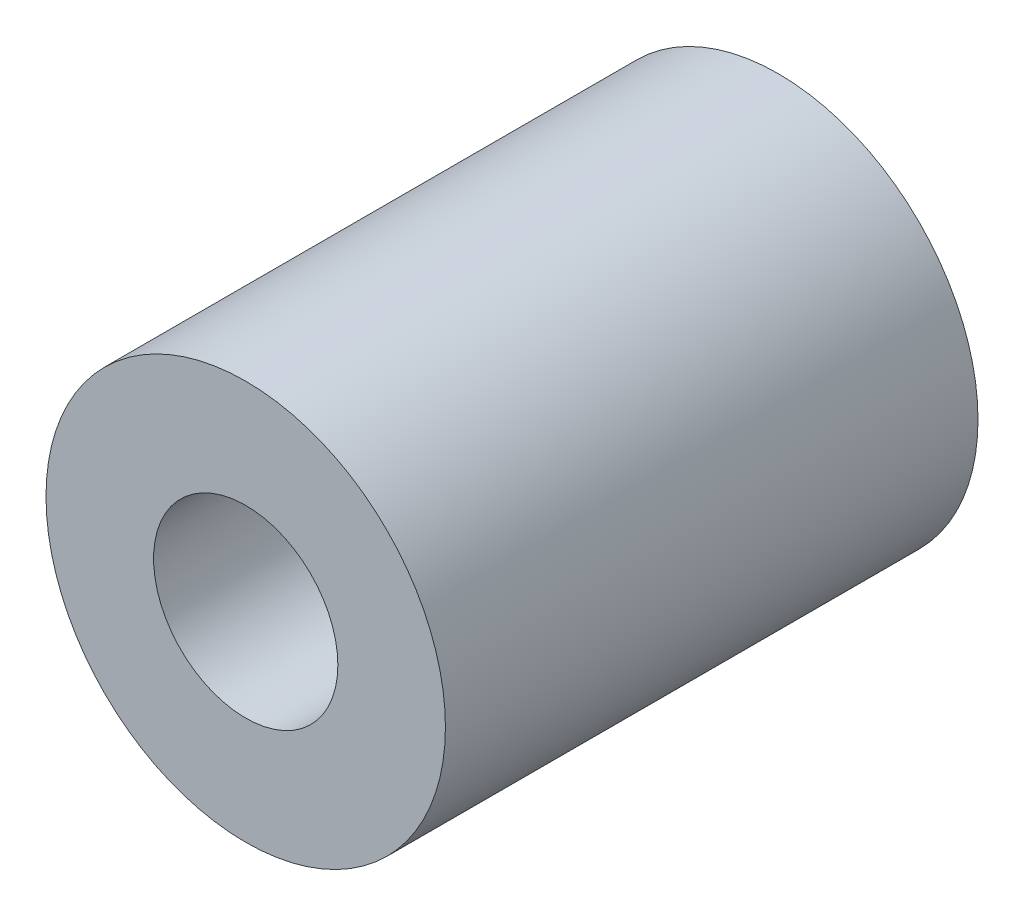
ISO-10303-21;
HEADER;
FILE_DESCRIPTION(('STEP AP214'),'2;1');
FILE_NAME('part.step','',(''),(''),'','','');
FILE_SCHEMA(('AUTOMOTIVE_DESIGN { 1 0 10303 214 1 1 1 1 }'));
ENDSEC;
DATA;
#1=APPLICATION_CONTEXT('core data for automotive mechanical design processes');
#2=APPLICATION_PROTOCOL_DEFINITION('international standard','automotive_design',2000,#1);
#3=PRODUCT_CONTEXT('',#1,'mechanical');
#4=PRODUCT('Part','Part','',(#3));
#5=PRODUCT_RELATED_PRODUCT_CATEGORY('part','',(#4));
#6=PRODUCT_DEFINITION_FORMATION('','',#4);
#7=PRODUCT_DEFINITION_CONTEXT('part definition',#1,'design');
#8=PRODUCT_DEFINITION('design','',#6,#7);
#9=PRODUCT_DEFINITION_SHAPE('','',#8);
#10=(LENGTH_UNIT() NAMED_UNIT(*) SI_UNIT(.MILLI.,.METRE.));
#11=(NAMED_UNIT(*) PLANE_ANGLE_UNIT() SI_UNIT($,.RADIAN.));
#12=(NAMED_UNIT(*) SI_UNIT($,.STERADIAN.) SOLID_ANGLE_UNIT());
#13=UNCERTAINTY_MEASURE_WITH_UNIT(LENGTH_MEASURE(1.E-05),#10,'distance_accuracy_value','');
#14=(GEOMETRIC_REPRESENTATION_CONTEXT(3) GLOBAL_UNCERTAINTY_ASSIGNED_CONTEXT((#13)) GLOBAL_UNIT_ASSIGNED_CONTEXT((#10,
#11,#12)) REPRESENTATION_CONTEXT('',''));
#15=CARTESIAN_POINT('',(0.,0.,0.));
#16=DIRECTION('',(0.,0.,1.));
#17=DIRECTION('',(1.,0.,0.));
#18=AXIS2_PLACEMENT_3D('',#15,#16,#17);
#19=CARTESIAN_POINT('',(0.,0.,6.35));
#20=DIRECTION('',(0.,0.,1.));
#21=DIRECTION('',(1.,0.,0.));
#22=AXIS2_PLACEMENT_3D('',#19,#20,#21);
#23=PLANE('',#22);
#24=CARTESIAN_POINT('',(0.,0.,6.35));
#25=DIRECTION('',(0.,0.,1.));
#26=DIRECTION('',(1.,0.,0.));
#27=AXIS2_PLACEMENT_3D('',#24,#25,#26);
#28=CIRCLE('',#27,4.7625);
#29=CARTESIAN_POINT('',(4.7625,0.,6.35));
#30=VERTEX_POINT('',#29);
#31=EDGE_CURVE('E10',#30,#30,#28,.T.);
#32=ORIENTED_EDGE('',*,*,#31,.T.);
#33=EDGE_LOOP('',(#32));
#34=FACE_BOUND('',#33,.T.);
#35=CARTESIAN_POINT('',(0.,0.,6.35));
#36=DIRECTION('',(0.,0.,1.));
#37=DIRECTION('',(1.,0.,0.));
#38=AXIS2_PLACEMENT_3D('',#35,#36,#37);
#39=CIRCLE('',#38,2.1971);
#40=CARTESIAN_POINT('',(2.1971,0.,6.35));
#41=VERTEX_POINT('',#40);
#42=EDGE_CURVE('E52',#41,#41,#39,.T.);
#43=ORIENTED_EDGE('',*,*,#42,.F.);
#44=EDGE_LOOP('',(#43));
#45=FACE_BOUND('',#44,.T.);
#46=ADVANCED_FACE('F33',(#34,#45),#23,.T.);
#47=CARTESIAN_POINT('',(0.,0.,-6.35));
#48=DIRECTION('',(0.,0.,1.));
#49=DIRECTION('',(1.,0.,0.));
#50=AXIS2_PLACEMENT_3D('',#47,#48,#49);
#51=PLANE('',#50);
#52=CARTESIAN_POINT('',(0.,0.,-6.35));
#53=DIRECTION('',(0.,0.,1.));
#54=DIRECTION('',(1.,0.,0.));
#55=AXIS2_PLACEMENT_3D('',#52,#53,#54);
#56=CIRCLE('',#55,4.7625);
#57=CARTESIAN_POINT('',(4.7625,0.,-6.35));
#58=VERTEX_POINT('',#57);
#59=EDGE_CURVE('E47',#58,#58,#56,.T.);
#60=ORIENTED_EDGE('',*,*,#59,.F.);
#61=EDGE_LOOP('',(#60));
#62=FACE_BOUND('',#61,.T.);
#63=CARTESIAN_POINT('',(0.,0.,-6.35));
#64=DIRECTION('',(0.,0.,1.));
#65=DIRECTION('',(1.,0.,0.));
#66=AXIS2_PLACEMENT_3D('',#63,#64,#65);
#67=CIRCLE('',#66,2.1971);
#68=CARTESIAN_POINT('',(2.1971,0.,-6.35));
#69=VERTEX_POINT('',#68);
#70=EDGE_CURVE('E54',#69,#69,#67,.T.);
#71=ORIENTED_EDGE('',*,*,#70,.T.);
#72=EDGE_LOOP('',(#71));
#73=FACE_BOUND('',#72,.T.);
#74=ADVANCED_FACE('F75',(#62,#73),#51,.F.);
#75=CARTESIAN_POINT('',(0.,0.,6.35));
#76=DIRECTION('',(0.,0.,-1.));
#77=DIRECTION('',(-1.,0.,0.));
#78=AXIS2_PLACEMENT_3D('',#75,#76,#77);
#79=CYLINDRICAL_SURFACE('',#78,4.7625);
#80=CARTESIAN_POINT('',(0.,-4.7625,1.25));
#81=CARTESIAN_POINT('',(0.0689488269895446,-4.76249892350249,1.24999828264799));
#82=CARTESIAN_POINT('',(0.137916249732854,-4.76098791352569,1.24427612788419));
#83=CARTESIAN_POINT('',(0.273866948453048,-4.75510685303733,1.22157759892755));
#84=CARTESIAN_POINT('',(0.340849208276613,-4.75073536386706,1.20459556159565));
#85=CARTESIAN_POINT('',(0.47084732481961,-4.73961624911541,1.15996544317831));
#86=CARTESIAN_POINT('',(0.533868088670454,-4.73287163434153,1.1323308728393));
#87=CARTESIAN_POINT('',(0.654380149036171,-4.71772047020067,1.06722956638843));
#88=CARTESIAN_POINT('',(0.711871122906729,-4.70931382394719,1.02976225704488));
#89=CARTESIAN_POINT('',(0.820986470277112,-4.69153581720155,0.945167995705838));
#90=CARTESIAN_POINT('',(0.872468553444096,-4.68214837483676,0.897860882576246));
#91=CARTESIAN_POINT('',(0.966866884789414,-4.66357097403559,0.795315170250191));
#92=CARTESIAN_POINT('',(1.00978206633533,-4.65438104031722,0.740075584882));
#93=CARTESIAN_POINT('',(1.08651582428672,-4.63707529018651,0.622105182390697));
#94=CARTESIAN_POINT('',(1.12017187342694,-4.6289797969026,0.559265395135516));
#95=CARTESIAN_POINT('',(1.17638558308837,-4.61501548950117,0.428572572220533));
#96=CARTESIAN_POINT('',(1.1989452192048,-4.60914627906091,0.360720431431592));
#97=CARTESIAN_POINT('',(1.23183379886142,-4.60046491688714,0.223501977728141));
#98=CARTESIAN_POINT('',(1.2424201786025,-4.59758852991801,0.154201528998975));
#99=CARTESIAN_POINT('',(1.25186415000505,-4.59502647971797,0.0147531652911871));
#100=CARTESIAN_POINT('',(1.2507238593528,-4.59534024038718,-0.0553945943886586));
#101=CARTESIAN_POINT('',(1.23695149883691,-4.59906547949983,-0.192546426575364));
#102=CARTESIAN_POINT('',(1.22462970188497,-4.60239331631598,-0.259584287194935));
#103=CARTESIAN_POINT('',(1.1893405287158,-4.61163798030708,-0.390606243299084));
#104=CARTESIAN_POINT('',(1.16637232540632,-4.61755500862773,-0.454590101099907));
#105=CARTESIAN_POINT('',(1.11018652844069,-4.63138572997379,-0.578502515707767));
#106=CARTESIAN_POINT('',(1.07685917787071,-4.63932063065522,-0.638378838302697));
#107=CARTESIAN_POINT('',(1.00097774509561,-4.65628148655067,-0.751798748291378));
#108=CARTESIAN_POINT('',(0.958421898098484,-4.66530765030377,-0.805341121394732));
#109=CARTESIAN_POINT('',(0.86369968438839,-4.68378320724794,-0.906347373388647));
#110=CARTESIAN_POINT('',(0.811272432129535,-4.69323696794645,-0.953566133353353));
#111=CARTESIAN_POINT('',(0.699128555580213,-4.71124674232189,-1.03859070192068));
#112=CARTESIAN_POINT('',(0.639411661618624,-4.71980272276477,-1.07639616213276));
#113=CARTESIAN_POINT('',(0.514011757722165,-4.73510285261534,-1.14162423624816));
#114=CARTESIAN_POINT('',(0.448305300721091,-4.741839433184,-1.1690036648251));
#115=CARTESIAN_POINT('',(0.313005240952782,-4.75268695115514,-1.21225782022923));
#116=CARTESIAN_POINT('',(0.243412463556184,-4.75679844378086,-1.22813497995713));
#117=CARTESIAN_POINT('',(0.104408120703846,-4.76184902928973,-1.24755175001477));
#118=CARTESIAN_POINT('',(0.035046169646804,-4.76287382691041,-1.25142475686745));
#119=CARTESIAN_POINT('',(-0.103335803501143,-4.76188136816725,-1.24764237430327));
#120=CARTESIAN_POINT('',(-0.172355859057596,-4.75986441568581,-1.23998813650211));
#121=CARTESIAN_POINT('',(-0.306912963279038,-4.7530703319408,-1.21364236805613));
#122=CARTESIAN_POINT('',(-0.372488766286751,-4.74833947030658,-1.19513574579217));
#123=CARTESIAN_POINT('',(-0.499599496842099,-4.73665325835686,-1.14782436091348));
#124=CARTESIAN_POINT('',(-0.561133992851573,-4.72969767094507,-1.11901850063675));
#125=CARTESIAN_POINT('',(-0.679718836805755,-4.71413156698966,-1.05130081725949));
#126=CARTESIAN_POINT('',(-0.736660907636652,-4.70549194189251,-1.0122062398836));
#127=CARTESIAN_POINT('',(-0.843293871093431,-4.68755697205323,-0.925251604258792));
#128=CARTESIAN_POINT('',(-0.892983374645442,-4.67826150220249,-0.877389870797003));
#129=CARTESIAN_POINT('',(-0.985097687855375,-4.65974890421523,-0.772705573140374));
#130=CARTESIAN_POINT('',(-1.02728759830267,-4.65054081563012,-0.715674341961438));
#131=CARTESIAN_POINT('',(-1.10150190977156,-4.63352511650848,-0.595148006946545));
#132=CARTESIAN_POINT('',(-1.13352674443343,-4.62571744623653,-0.531653178999112));
#133=CARTESIAN_POINT('',(-1.18626077762452,-4.61247560327065,-0.400326458459847));
#134=CARTESIAN_POINT('',(-1.20703611666268,-4.6070275958912,-0.332522594238828));
#135=CARTESIAN_POINT('',(-1.23684299798428,-4.59911599923542,-0.194217260274963));
#136=CARTESIAN_POINT('',(-1.24587742774387,-4.59665167618307,-0.123716458190293));
#137=CARTESIAN_POINT('',(-1.25178379299123,-4.59504639964924,0.015580437205149));
#138=CARTESIAN_POINT('',(-1.24903271196828,-4.59580243207657,0.0843596021718627));
#139=CARTESIAN_POINT('',(-1.23231761019832,-4.60031226908765,0.22043636023921));
#140=CARTESIAN_POINT('',(-1.2183538610966,-4.60406600104719,0.287733989191904));
#141=CARTESIAN_POINT('',(-1.17982517655743,-4.61408795675081,0.418479523993408));
#142=CARTESIAN_POINT('',(-1.15533776233217,-4.62033777009164,0.481951784017807));
#143=CARTESIAN_POINT('',(-1.09651728065577,-4.63464866254929,0.603934428206901));
#144=CARTESIAN_POINT('',(-1.06218271349251,-4.64271001752169,0.662444054807119));
#145=CARTESIAN_POINT('',(-0.983489925232757,-4.66002342411812,0.774645773083874));
#146=CARTESIAN_POINT('',(-0.93887332756531,-4.66930291627762,0.828152443087271));
#147=CARTESIAN_POINT('',(-0.841377495724149,-4.68785113845597,0.927041850044485));
#148=CARTESIAN_POINT('',(-0.788496268453524,-4.69711986533406,0.972422621678524));
#149=CARTESIAN_POINT('',(-0.674662319319917,-4.71482962144214,1.05468590136431));
#150=CARTESIAN_POINT('',(-0.613566194670518,-4.72324975484127,1.09137484203502));
#151=CARTESIAN_POINT('',(-0.485855224781159,-4.73808723116027,1.15390299162757));
#152=CARTESIAN_POINT('',(-0.419244063470453,-4.74450589757513,1.17974937424809));
#153=CARTESIAN_POINT('',(-0.294038318804136,-4.75375633848032,1.2163667798388));
#154=CARTESIAN_POINT('',(-0.235998618132916,-4.75701167518968,1.22895047606859));
#155=CARTESIAN_POINT('',(-0.118643789063094,-4.7613838704496,1.24576743980601));
#156=CARTESIAN_POINT('',(-0.0593287788483263,-4.76250092629978,1.25000147773939));
#157=CARTESIAN_POINT('',(0.,-4.7625,1.25));
#158=B_SPLINE_CURVE_WITH_KNOTS('',3,(#80,#81,#82,#83,#84,#85,#86,#87,#88,#89,#90,#91,#92,#93,
#94,#95,#96,#97,#98,#99,#100,#101,#102,#103,#104,#105,#106,#107,#108,#109,#110,#111,#112,#113,
#114,#115,#116,#117,#118,#119,#120,#121,#122,#123,#124,#125,#126,#127,#128,#129,#130,#131,#132,
#133,#134,#135,#136,#137,#138,#139,#140,#141,#142,#143,#144,#145,#146,#147,#148,#149,#150,#151,
#152,#153,#154,#155,#156,#157),.UNSPECIFIED.,.T.,.F.,(4,2,2,2,2,2,2,2,2,2,2,2,2,2,2,2,2,2,2,2,2,
2,2,2,2,2,2,2,2,2,2,2,2,2,2,2,2,2,4),(0.,0.206628947540086,0.413361897673244,0.619833503863805,
0.826317149667353,1.03697999238149,1.24766904759022,1.46184949115505,1.6759917884144,
1.88543667630245,2.09484374179415,2.29861197653732,2.50239604417057,2.70841740289269,
2.91447819447153,3.12704121112377,3.33961209366174,3.55305412213805,3.76645099126346,
3.97386542536043,4.181259139339,4.38521782999528,4.58919826444182,4.79708014026654,
5.0050017793107,5.21859009069136,5.4321692892084,5.64447874168112,5.85673597038206,
6.0622552854833,6.26776962169218,6.47179533639978,6.67585214054696,6.88573951059619,
7.09567757538122,7.30992507905385,7.52403060697189,7.7018461691922,7.87964532354369),.UNSPECIFIED.);
#159=CARTESIAN_POINT('',(0.,-4.7625,1.25));
#160=VERTEX_POINT('',#159);
#161=EDGE_CURVE('E57',#160,#160,#158,.T.);
#162=ORIENTED_EDGE('',*,*,#161,.T.);
#163=EDGE_LOOP('',(#162));
#164=FACE_BOUND('',#163,.T.);
#165=ORIENTED_EDGE('',*,*,#31,.F.);
#166=EDGE_LOOP('',(#165));
#167=FACE_BOUND('',#166,.T.);
#168=ORIENTED_EDGE('',*,*,#59,.T.);
#169=EDGE_LOOP('',(#168));
#170=FACE_BOUND('',#169,.T.);
#171=ADVANCED_FACE('F35',(#164,#167,#170),#79,.T.);
#172=CARTESIAN_POINT('',(0.,0.,6.35));
#173=DIRECTION('',(0.,0.,-1.));
#174=DIRECTION('',(-1.,0.,0.));
#175=AXIS2_PLACEMENT_3D('',#172,#173,#174);
#176=CYLINDRICAL_SURFACE('',#175,2.1971);
#177=CARTESIAN_POINT('',(0.,-2.1971,1.25));
#178=CARTESIAN_POINT('',(0.0645006291983453,-2.19709344654462,1.24999242885589));
#179=CARTESIAN_POINT('',(0.129098825905808,-2.19422787699474,1.24497315104389));
#180=CARTESIAN_POINT('',(0.256384164116618,-2.18303115398664,1.22512866137346));
#181=CARTESIAN_POINT('',(0.319065820058757,-2.17468561519554,1.21027763960044));
#182=CARTESIAN_POINT('',(0.440398335875488,-2.15338646413962,1.17157338317331));
#183=CARTESIAN_POINT('',(0.499066815570913,-2.14045477551999,1.14776294565859));
#184=CARTESIAN_POINT('',(0.611419870128688,-2.11111116632144,1.09206278823753));
#185=CARTESIAN_POINT('',(0.665105902343799,-2.09470026804421,1.06017544104751));
#186=CARTESIAN_POINT('',(0.77033547041945,-2.05843306918933,0.986658214682441));
#187=CARTESIAN_POINT('',(0.821447782440223,-2.03841392150716,0.944492879620832));
#188=CARTESIAN_POINT('',(0.916294525751416,-1.99757980083588,0.852797214644533));
#189=CARTESIAN_POINT('',(0.960020226511635,-1.97676392129443,0.803258297842109));
#190=CARTESIAN_POINT('',(1.04360050291168,-1.93405696147944,0.69191882748928));
#191=CARTESIAN_POINT('',(1.08253368280352,-1.91229083645976,0.62937263881205));
#192=CARTESIAN_POINT('',(1.14916524397546,-1.87301146469662,0.497357122372998));
#193=CARTESIAN_POINT('',(1.17688052165353,-1.85549183796834,0.427898404356612));
#194=CARTESIAN_POINT('',(1.21497109196512,-1.83070809668604,0.299643477693572));
#195=CARTESIAN_POINT('',(1.2278171663995,-1.82203700509207,0.241853325655474));
#196=CARTESIAN_POINT('',(1.24519340472589,-1.81020917934074,0.124505422227627));
#197=CARTESIAN_POINT('',(1.24973236631188,-1.80704661152239,0.0649496088019991));
#198=CARTESIAN_POINT('',(1.2502449269772,-1.80669205822205,-0.0542940433729006));
#199=CARTESIAN_POINT('',(1.24620721653005,-1.80950795617039,-0.113981952639227));
#200=CARTESIAN_POINT('',(1.22978218419539,-1.82070830758643,-0.231671766920514));
#201=CARTESIAN_POINT('',(1.2173891656546,-1.8290965602311,-0.289672493450614));
#202=CARTESIAN_POINT('',(1.18491442316601,-1.85029620796914,-0.402380595180192));
#203=CARTESIAN_POINT('',(1.16485726852367,-1.86309345616015,-0.457097854413335));
#204=CARTESIAN_POINT('',(1.11774946141568,-1.89173012932771,-0.562562147548056));
#205=CARTESIAN_POINT('',(1.09069612429572,-1.90757072152945,-0.61330764760226));
#206=CARTESIAN_POINT('',(1.02539247023902,-1.94355793308899,-0.717951725654275));
#207=CARTESIAN_POINT('',(0.986045891159935,-1.96398877915982,-0.771069357464126));
#208=CARTESIAN_POINT('',(0.899533674474515,-2.00508962150327,-0.870451190237627));
#209=CARTESIAN_POINT('',(0.852361447948059,-2.02575980553123,-0.916709553249254));
#210=CARTESIAN_POINT('',(0.745209724101643,-2.06774676910485,-1.00626215239727));
#211=CARTESIAN_POINT('',(0.684387884526027,-2.08887728908566,-1.04864617764023));
#212=CARTESIAN_POINT('',(0.555181780761175,-2.12686234933244,-1.12240588486982));
#213=CARTESIAN_POINT('',(0.486802360546742,-2.14371960595278,-1.15378856488466));
#214=CARTESIAN_POINT('',(0.349313301233325,-2.17020318592356,-1.20225439687405));
#215=CARTESIAN_POINT('',(0.280584369335156,-2.18025047543403,-1.22017945672252));
#216=CARTESIAN_POINT('',(0.140470274389572,-2.19373016694913,-1.24410806929347));
#217=CARTESIAN_POINT('',(0.0690877544394367,-2.1971689804002,-1.25012317704859));
#218=CARTESIAN_POINT('',(-0.065038444575459,-2.1970371197676,-1.24988777691278));
#219=CARTESIAN_POINT('',(-0.127790739569576,-2.19425816479093,-1.24502269949659));
#220=CARTESIAN_POINT('',(-0.25142067494666,-2.18354863123188,-1.22604967968637));
#221=CARTESIAN_POINT('',(-0.312298278243789,-2.17561795080467,-1.2119415545658));
#222=CARTESIAN_POINT('',(-0.430042150045564,-2.15542401736892,-1.17530182147159));
#223=CARTESIAN_POINT('',(-0.486940059626109,-2.14320112422678,-1.1528485720041));
#224=CARTESIAN_POINT('',(-0.596203323727055,-2.11541297585585,-1.1003270564859));
#225=CARTESIAN_POINT('',(-0.64856756390997,-2.0998469021556,-1.07025692535991));
#226=CARTESIAN_POINT('',(-0.753139701319633,-2.06479473415811,-0.99982900896591));
#227=CARTESIAN_POINT('',(-0.804765123854709,-2.04506933004641,-0.95872660338061));
#228=CARTESIAN_POINT('',(-0.900786829797233,-2.00463265784691,-0.86913896774636));
#229=CARTESIAN_POINT('',(-0.945174762166057,-1.9839202860382,-0.82064533230548));
#230=CARTESIAN_POINT('',(-1.03042320747223,-1.94113135178936,-0.711368038935463));
#231=CARTESIAN_POINT('',(-1.07036076434499,-1.91915483100233,-0.649819515685487));
#232=CARTESIAN_POINT('',(-1.13921555072589,-1.87910347078921,-0.519698569213003));
#233=CARTESIAN_POINT('',(-1.16814760822478,-1.86102339592914,-0.451135755803134));
#234=CARTESIAN_POINT('',(-1.20877091981253,-1.83482343208257,-0.323790685334378));
#235=CARTESIAN_POINT('',(-1.22282022086747,-1.825403045691,-0.266029391379985));
#236=CARTESIAN_POINT('',(-1.24257284075222,-1.81201783729455,-0.148502959884317));
#237=CARTESIAN_POINT('',(-1.24828547165003,-1.80804692851442,-0.0887401345347995));
#238=CARTESIAN_POINT('',(-1.25105222815068,-1.80613412752322,0.0311981919414011));
#239=CARTESIAN_POINT('',(-1.24809004504417,-1.80820359122929,0.0913742579007287));
#240=CARTESIAN_POINT('',(-1.23365093942907,-1.81808312120887,0.21022430219143));
#241=CARTESIAN_POINT('',(-1.22216861128149,-1.82589683191296,0.268897302437507));
#242=CARTESIAN_POINT('',(-1.19151089738881,-1.84604340552025,0.382372134945723));
#243=CARTESIAN_POINT('',(-1.17245283835314,-1.85830710905659,0.437218661476101));
#244=CARTESIAN_POINT('',(-1.12733563279166,-1.88601748015873,0.543073637247866));
#245=CARTESIAN_POINT('',(-1.10127388149181,-1.90146533145591,0.59408064946533));
#246=CARTESIAN_POINT('',(-1.03826497583076,-1.93668432527355,0.699151711048833));
#247=CARTESIAN_POINT('',(-1.0002606380083,-1.95675505606691,0.752481654622673));
#248=CARTESIAN_POINT('',(-0.916503769940231,-1.99735772076009,0.852514984251887));
#249=CARTESIAN_POINT('',(-0.870744629528478,-2.01789003505214,0.899212654035242));
#250=CARTESIAN_POINT('',(-0.766172744809087,-2.0600427725367,0.990380914400274));
#251=CARTESIAN_POINT('',(-0.706450133583926,-2.08149357276184,1.0338959911284));
#252=CARTESIAN_POINT('',(-0.579274907063508,-2.12039942655347,1.11014485181236));
#253=CARTESIAN_POINT('',(-0.511826622787586,-2.13785670259974,1.14288463691628));
#254=CARTESIAN_POINT('',(-0.383548716359696,-2.16417242166307,1.19131294140483));
#255=CARTESIAN_POINT('',(-0.323668178012929,-2.17400698524977,1.20899619323023));
#256=CARTESIAN_POINT('',(-0.201453951158752,-2.18870324369747,1.23523106164878));
#257=CARTESIAN_POINT('',(-0.139127990811289,-2.19357947083427,1.2438093669801));
#258=CARTESIAN_POINT('',(-0.0510419085973565,-2.19665732726349,1.24922091730659));
#259=CARTESIAN_POINT('',(-0.0255285961958105,-2.19710259378115,1.25000299657047));
#260=CARTESIAN_POINT('',(0.,-2.1971,1.25));
#261=B_SPLINE_CURVE_WITH_KNOTS('',3,(#177,#178,#179,#180,#181,#182,#183,#184,#185,#186,#187,
#188,#189,#190,#191,#192,#193,#194,#195,#196,#197,#198,#199,#200,#201,#202,#203,#204,#205,#206,
#207,#208,#209,#210,#211,#212,#213,#214,#215,#216,#217,#218,#219,#220,#221,#222,#223,#224,#225,
#226,#227,#228,#229,#230,#231,#232,#233,#234,#235,#236,#237,#238,#239,#240,#241,#242,#243,#244,
#245,#246,#247,#248,#249,#250,#251,#252,#253,#254,#255,#256,#257,#258,#259,#260),.UNSPECIFIED.,
.T.,.F.,(4,2,2,2,2,2,2,2,2,2,2,2,2,2,2,2,2,2,2,2,2,2,2,2,2,2,2,2,2,2,2,2,2,2,2,2,2,2,2,2,2,4),
(0.,0.193421076474475,0.387351938693713,0.580367959784148,0.773327345080817,0.980153514417806,
1.18722245495872,1.41655044332124,1.6455317209913,1.82425231241462,2.00278351903377,
2.18155028983629,2.36043906733741,2.53875911903196,2.71714769951264,2.92389166256597,
3.13081058855077,3.36087280009993,3.59078840086931,3.8047323428387,4.01846861454017,
4.20655309413433,4.39464129209759,4.58100626306811,4.76741691169076,4.97321162537864,
5.17924214184758,5.40790261038557,5.63625389832528,5.81604173157406,5.99562858753109,
6.17555328461295,6.35559223332552,6.53294521936388,6.71036425703695,6.91503852025312,
7.11988813276966,7.34955991115362,7.57910355973942,7.76791840016987,7.95617823838082,
8.03273204286995),.UNSPECIFIED.);
#262=CARTESIAN_POINT('',(0.,-2.1971,1.25));
#263=VERTEX_POINT('',#262);
#264=EDGE_CURVE('E38',#263,#263,#261,.T.);
#265=ORIENTED_EDGE('',*,*,#264,.F.);
#266=EDGE_LOOP('',(#265));
#267=FACE_BOUND('',#266,.T.);
#268=ORIENTED_EDGE('',*,*,#42,.T.);
#269=EDGE_LOOP('',(#268));
#270=FACE_BOUND('',#269,.T.);
#271=ORIENTED_EDGE('',*,*,#70,.F.);
#272=EDGE_LOOP('',(#271));
#273=FACE_BOUND('',#272,.T.);
#274=ADVANCED_FACE('F67',(#267,#270,#273),#176,.F.);
#275=CARTESIAN_POINT('',(0.,-4.7625,0.));
#276=DIRECTION('',(0.,1.,0.));
#277=DIRECTION('',(0.,0.,1.));
#278=AXIS2_PLACEMENT_3D('',#275,#276,#277);
#279=CYLINDRICAL_SURFACE('',#278,1.25);
#280=ORIENTED_EDGE('',*,*,#264,.T.);
#281=EDGE_LOOP('',(#280));
#282=FACE_BOUND('',#281,.T.);
#283=ORIENTED_EDGE('',*,*,#161,.F.);
#284=EDGE_LOOP('',(#283));
#285=FACE_BOUND('',#284,.T.);
#286=ADVANCED_FACE('F64',(#282,#285),#279,.F.);
#287=CLOSED_SHELL('',(#46,#74,#171,#274,#286));
#288=MANIFOLD_SOLID_BREP('B2',#287);
#289=ADVANCED_BREP_SHAPE_REPRESENTATION('',(#18,#288),#14);
#290=SHAPE_DEFINITION_REPRESENTATION(#9,#289);
ENDSEC;
END-ISO-10303-21;
